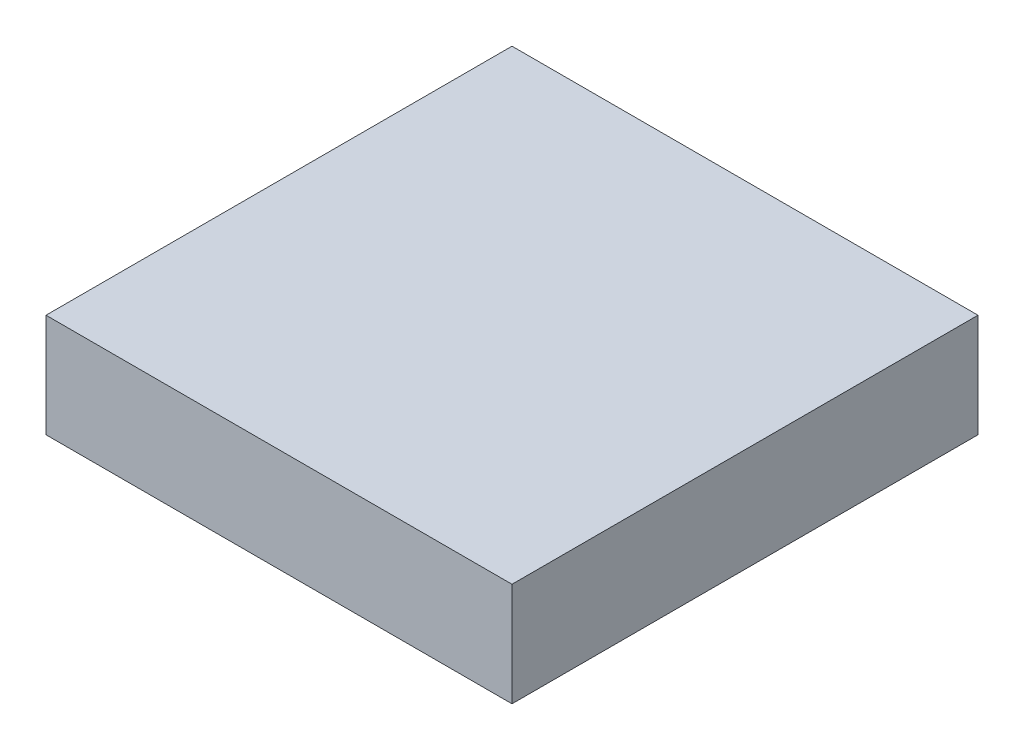
ISO-10303-21;
HEADER;
FILE_DESCRIPTION(('STEP AP214'),'2;1');
FILE_NAME('part.step','',(''),(''),'','','');
FILE_SCHEMA(('AUTOMOTIVE_DESIGN { 1 0 10303 214 1 1 1 1 }'));
ENDSEC;
DATA;
#1=APPLICATION_CONTEXT('core data for automotive mechanical design processes');
#2=APPLICATION_PROTOCOL_DEFINITION('international standard','automotive_design',2000,#1);
#3=PRODUCT_CONTEXT('',#1,'mechanical');
#4=PRODUCT('Part','Part','',(#3));
#5=PRODUCT_RELATED_PRODUCT_CATEGORY('part','',(#4));
#6=PRODUCT_DEFINITION_FORMATION('','',#4);
#7=PRODUCT_DEFINITION_CONTEXT('part definition',#1,'design');
#8=PRODUCT_DEFINITION('design','',#6,#7);
#9=PRODUCT_DEFINITION_SHAPE('','',#8);
#10=(LENGTH_UNIT() NAMED_UNIT(*) SI_UNIT(.MILLI.,.METRE.));
#11=(NAMED_UNIT(*) PLANE_ANGLE_UNIT() SI_UNIT($,.RADIAN.));
#12=(NAMED_UNIT(*) SI_UNIT($,.STERADIAN.) SOLID_ANGLE_UNIT());
#13=UNCERTAINTY_MEASURE_WITH_UNIT(LENGTH_MEASURE(1.E-05),#10,'distance_accuracy_value','');
#14=(GEOMETRIC_REPRESENTATION_CONTEXT(3) GLOBAL_UNCERTAINTY_ASSIGNED_CONTEXT((#13)) GLOBAL_UNIT_ASSIGNED_CONTEXT((#10,
#11,#12)) REPRESENTATION_CONTEXT('',''));
#15=CARTESIAN_POINT('',(0.,0.,0.));
#16=DIRECTION('',(0.,0.,1.));
#17=DIRECTION('',(1.,0.,0.));
#18=AXIS2_PLACEMENT_3D('',#15,#16,#17);
#19=CARTESIAN_POINT('',(0.,10.,0.));
#20=DIRECTION('',(-1.,0.,0.));
#21=DIRECTION('',(0.,0.,1.));
#22=AXIS2_PLACEMENT_3D('',#19,#20,#21);
#23=PLANE('',#22);
#24=DIRECTION('',(0.,0.,-1.));
#25=VECTOR('',#24,1.);
#26=CARTESIAN_POINT('',(0.,0.,0.));
#27=LINE('',#26,#25);
#28=CARTESIAN_POINT('',(0.,0.,0.));
#29=VERTEX_POINT('',#28);
#30=CARTESIAN_POINT('',(0.,0.,-45.));
#31=VERTEX_POINT('',#30);
#32=EDGE_CURVE('E74',#29,#31,#27,.T.);
#33=ORIENTED_EDGE('',*,*,#32,.T.);
#34=DIRECTION('',(0.,-1.,0.));
#35=VECTOR('',#34,1.);
#36=CARTESIAN_POINT('',(0.,10.,-45.));
#37=LINE('',#36,#35);
#38=CARTESIAN_POINT('',(0.,10.,-45.));
#39=VERTEX_POINT('',#38);
#40=EDGE_CURVE('E11',#39,#31,#37,.T.);
#41=ORIENTED_EDGE('',*,*,#40,.F.);
#42=DIRECTION('',(0.,0.,-1.));
#43=VECTOR('',#42,1.);
#44=CARTESIAN_POINT('',(0.,10.,0.));
#45=LINE('',#44,#43);
#46=CARTESIAN_POINT('',(0.,10.,0.));
#47=VERTEX_POINT('',#46);
#48=EDGE_CURVE('E92',#47,#39,#45,.T.);
#49=ORIENTED_EDGE('',*,*,#48,.F.);
#50=DIRECTION('',(0.,-1.,0.));
#51=VECTOR('',#50,1.);
#52=CARTESIAN_POINT('',(0.,10.,0.));
#53=LINE('',#52,#51);
#54=EDGE_CURVE('E86',#47,#29,#53,.T.);
#55=ORIENTED_EDGE('',*,*,#54,.T.);
#56=EDGE_LOOP('',(#33,#41,#49,#55));
#57=FACE_BOUND('',#56,.T.);
#58=ADVANCED_FACE('F30',(#57),#23,.F.);
#59=CARTESIAN_POINT('',(0.,10.,-45.));
#60=DIRECTION('',(0.,0.,1.));
#61=DIRECTION('',(1.,0.,0.));
#62=AXIS2_PLACEMENT_3D('',#59,#60,#61);
#63=PLANE('',#62);
#64=DIRECTION('',(-1.,0.,0.));
#65=VECTOR('',#64,1.);
#66=CARTESIAN_POINT('',(0.,0.,-45.));
#67=LINE('',#66,#65);
#68=CARTESIAN_POINT('',(-45.,0.,-45.));
#69=VERTEX_POINT('',#68);
#70=EDGE_CURVE('E70',#31,#69,#67,.T.);
#71=ORIENTED_EDGE('',*,*,#70,.T.);
#72=DIRECTION('',(0.,-1.,0.));
#73=VECTOR('',#72,1.);
#74=CARTESIAN_POINT('',(-45.,10.,-45.));
#75=LINE('',#74,#73);
#76=CARTESIAN_POINT('',(-45.,10.,-45.));
#77=VERTEX_POINT('',#76);
#78=EDGE_CURVE('E37',#77,#69,#75,.T.);
#79=ORIENTED_EDGE('',*,*,#78,.F.);
#80=DIRECTION('',(-1.,0.,0.));
#81=VECTOR('',#80,1.);
#82=CARTESIAN_POINT('',(0.,10.,-45.));
#83=LINE('',#82,#81);
#84=EDGE_CURVE('E82',#39,#77,#83,.T.);
#85=ORIENTED_EDGE('',*,*,#84,.F.);
#86=ORIENTED_EDGE('',*,*,#40,.T.);
#87=EDGE_LOOP('',(#71,#79,#85,#86));
#88=FACE_BOUND('',#87,.T.);
#89=ADVANCED_FACE('F81',(#88),#63,.F.);
#90=CARTESIAN_POINT('',(-45.,10.,0.));
#91=DIRECTION('',(1.,0.,0.));
#92=DIRECTION('',(0.,0.,-1.));
#93=AXIS2_PLACEMENT_3D('',#90,#91,#92);
#94=PLANE('',#93);
#95=DIRECTION('',(0.,0.,1.));
#96=VECTOR('',#95,1.);
#97=CARTESIAN_POINT('',(-45.,0.,0.));
#98=LINE('',#97,#96);
#99=CARTESIAN_POINT('',(-45.,0.,0.));
#100=VERTEX_POINT('',#99);
#101=EDGE_CURVE('E75',#69,#100,#98,.T.);
#102=ORIENTED_EDGE('',*,*,#101,.T.);
#103=DIRECTION('',(0.,-1.,0.));
#104=VECTOR('',#103,1.);
#105=CARTESIAN_POINT('',(-45.,10.,0.));
#106=LINE('',#105,#104);
#107=CARTESIAN_POINT('',(-45.,10.,0.));
#108=VERTEX_POINT('',#107);
#109=EDGE_CURVE('E98',#108,#100,#106,.T.);
#110=ORIENTED_EDGE('',*,*,#109,.F.);
#111=DIRECTION('',(0.,0.,1.));
#112=VECTOR('',#111,1.);
#113=CARTESIAN_POINT('',(-45.,10.,0.));
#114=LINE('',#113,#112);
#115=EDGE_CURVE('E49',#77,#108,#114,.T.);
#116=ORIENTED_EDGE('',*,*,#115,.F.);
#117=ORIENTED_EDGE('',*,*,#78,.T.);
#118=EDGE_LOOP('',(#102,#110,#116,#117));
#119=FACE_BOUND('',#118,.T.);
#120=ADVANCED_FACE('F101',(#119),#94,.F.);
#121=CARTESIAN_POINT('',(0.,10.,0.));
#122=DIRECTION('',(0.,0.,-1.));
#123=DIRECTION('',(-1.,0.,0.));
#124=AXIS2_PLACEMENT_3D('',#121,#122,#123);
#125=PLANE('',#124);
#126=DIRECTION('',(1.,0.,0.));
#127=VECTOR('',#126,1.);
#128=CARTESIAN_POINT('',(0.,0.,0.));
#129=LINE('',#128,#127);
#130=EDGE_CURVE('E90',#100,#29,#129,.T.);
#131=ORIENTED_EDGE('',*,*,#130,.T.);
#132=ORIENTED_EDGE('',*,*,#54,.F.);
#133=DIRECTION('',(1.,0.,0.));
#134=VECTOR('',#133,1.);
#135=CARTESIAN_POINT('',(0.,10.,0.));
#136=LINE('',#135,#134);
#137=EDGE_CURVE('E44',#108,#47,#136,.T.);
#138=ORIENTED_EDGE('',*,*,#137,.F.);
#139=ORIENTED_EDGE('',*,*,#109,.T.);
#140=EDGE_LOOP('',(#131,#132,#138,#139));
#141=FACE_BOUND('',#140,.T.);
#142=ADVANCED_FACE('F103',(#141),#125,.F.);
#143=CARTESIAN_POINT('',(0.,10.,0.));
#144=DIRECTION('',(0.,1.,0.));
#145=DIRECTION('',(0.,0.,1.));
#146=AXIS2_PLACEMENT_3D('',#143,#144,#145);
#147=PLANE('',#146);
#148=ORIENTED_EDGE('',*,*,#48,.T.);
#149=ORIENTED_EDGE('',*,*,#84,.T.);
#150=ORIENTED_EDGE('',*,*,#115,.T.);
#151=ORIENTED_EDGE('',*,*,#137,.T.);
#152=EDGE_LOOP('',(#148,#149,#150,#151));
#153=FACE_BOUND('',#152,.T.);
#154=ADVANCED_FACE('F104',(#153),#147,.T.);
#155=CARTESIAN_POINT('',(0.,0.,0.));
#156=DIRECTION('',(0.,1.,0.));
#157=DIRECTION('',(0.,0.,1.));
#158=AXIS2_PLACEMENT_3D('',#155,#156,#157);
#159=PLANE('',#158);
#160=ORIENTED_EDGE('',*,*,#32,.F.);
#161=ORIENTED_EDGE('',*,*,#130,.F.);
#162=ORIENTED_EDGE('',*,*,#101,.F.);
#163=ORIENTED_EDGE('',*,*,#70,.F.);
#164=EDGE_LOOP('',(#160,#161,#162,#163));
#165=FACE_BOUND('',#164,.T.);
#166=ADVANCED_FACE('F71',(#165),#159,.F.);
#167=CLOSED_SHELL('',(#58,#89,#120,#142,#154,#166));
#168=MANIFOLD_SOLID_BREP('B2',#167);
#169=ADVANCED_BREP_SHAPE_REPRESENTATION('',(#18,#168),#14);
#170=SHAPE_DEFINITION_REPRESENTATION(#9,#169);
ENDSEC;
END-ISO-10303-21;
